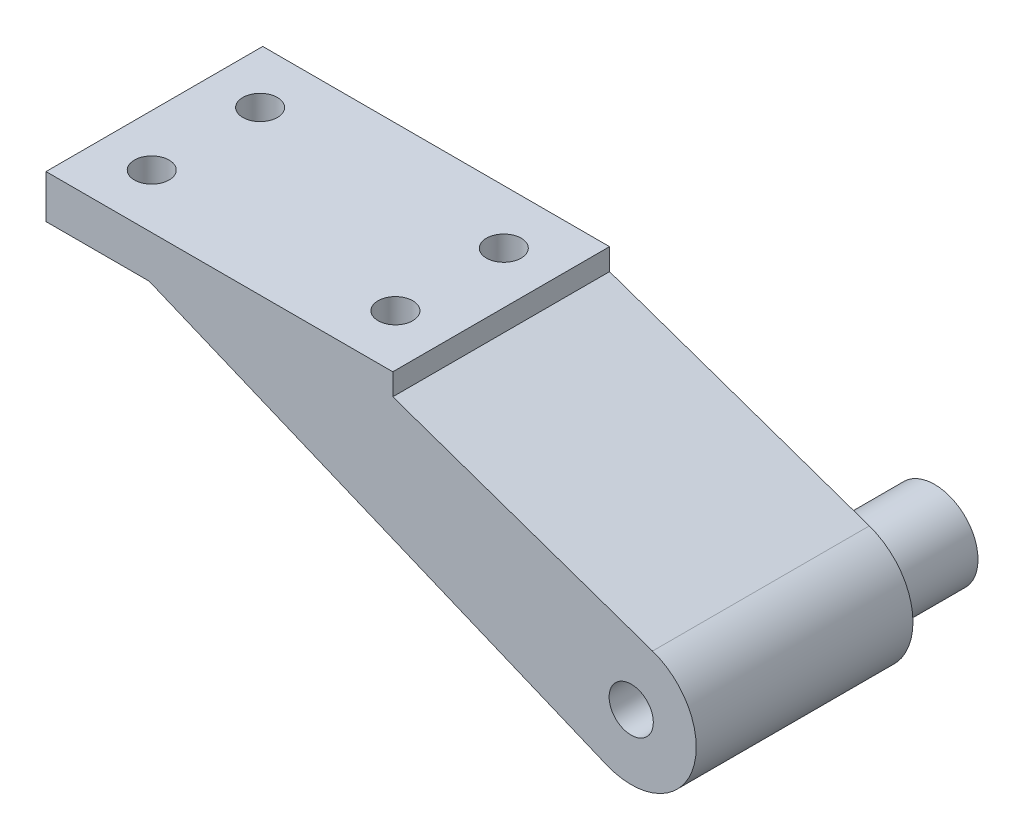
ISO-10303-21;
HEADER;
FILE_DESCRIPTION(('STEP AP214'),'2;1');
FILE_NAME('part.step','',(''),(''),'','','');
FILE_SCHEMA(('AUTOMOTIVE_DESIGN { 1 0 10303 214 1 1 1 1 }'));
ENDSEC;
DATA;
#1=APPLICATION_CONTEXT('core data for automotive mechanical design processes');
#2=APPLICATION_PROTOCOL_DEFINITION('international standard','automotive_design',2000,#1);
#3=PRODUCT_CONTEXT('',#1,'mechanical');
#4=PRODUCT('Part','Part','',(#3));
#5=PRODUCT_RELATED_PRODUCT_CATEGORY('part','',(#4));
#6=PRODUCT_DEFINITION_FORMATION('','',#4);
#7=PRODUCT_DEFINITION_CONTEXT('part definition',#1,'design');
#8=PRODUCT_DEFINITION('design','',#6,#7);
#9=PRODUCT_DEFINITION_SHAPE('','',#8);
#10=(LENGTH_UNIT() NAMED_UNIT(*) SI_UNIT(.MILLI.,.METRE.));
#11=(NAMED_UNIT(*) PLANE_ANGLE_UNIT() SI_UNIT($,.RADIAN.));
#12=(NAMED_UNIT(*) SI_UNIT($,.STERADIAN.) SOLID_ANGLE_UNIT());
#13=UNCERTAINTY_MEASURE_WITH_UNIT(LENGTH_MEASURE(1.E-05),#10,'distance_accuracy_value','');
#14=(GEOMETRIC_REPRESENTATION_CONTEXT(3) GLOBAL_UNCERTAINTY_ASSIGNED_CONTEXT((#13)) GLOBAL_UNIT_ASSIGNED_CONTEXT((#10,
#11,#12)) REPRESENTATION_CONTEXT('',''));
#15=CARTESIAN_POINT('',(0.,0.,0.));
#16=DIRECTION('',(0.,0.,1.));
#17=DIRECTION('',(1.,0.,0.));
#18=AXIS2_PLACEMENT_3D('',#15,#16,#17);
#19=CARTESIAN_POINT('',(43.2475049791949,-28.575,-7.9375));
#20=DIRECTION('',(0.,1.,0.));
#21=DIRECTION('',(0.,0.,1.));
#22=AXIS2_PLACEMENT_3D('',#19,#20,#21);
#23=CYLINDRICAL_SURFACE('',#22,2.54);
#24=CARTESIAN_POINT('',(43.2475049791949,6.35,-7.9375));
#25=DIRECTION('',(0.,1.,0.));
#26=DIRECTION('',(0.,0.,1.));
#27=AXIS2_PLACEMENT_3D('',#24,#25,#26);
#28=CIRCLE('',#27,2.54);
#29=CARTESIAN_POINT('',(43.2475049791949,6.35,-5.3975));
#30=VERTEX_POINT('',#29);
#31=EDGE_CURVE('E178',#30,#30,#28,.T.);
#32=ORIENTED_EDGE('',*,*,#31,.T.);
#33=EDGE_LOOP('',(#32));
#34=FACE_BOUND('',#33,.T.);
#35=CARTESIAN_POINT('',(43.2475049791949,0.,-7.9375));
#36=DIRECTION('',(0.,-1.,0.));
#37=DIRECTION('',(0.,0.,-1.));
#38=AXIS2_PLACEMENT_3D('',#35,#36,#37);
#39=CIRCLE('',#38,2.54);
#40=CARTESIAN_POINT('',(43.2475049791949,0.,-10.4775));
#41=VERTEX_POINT('',#40);
#42=EDGE_CURVE('E158',#41,#41,#39,.F.);
#43=ORIENTED_EDGE('',*,*,#42,.F.);
#44=EDGE_LOOP('',(#43));
#45=FACE_BOUND('',#44,.T.);
#46=ADVANCED_FACE('F32',(#34,#45),#23,.F.);
#47=CARTESIAN_POINT('',(43.2475049791949,-28.575,-23.8125));
#48=DIRECTION('',(0.,1.,0.));
#49=DIRECTION('',(0.,0.,1.));
#50=AXIS2_PLACEMENT_3D('',#47,#48,#49);
#51=CYLINDRICAL_SURFACE('',#50,2.54);
#52=CARTESIAN_POINT('',(43.2475049791949,6.35,-23.8125));
#53=DIRECTION('',(0.,1.,0.));
#54=DIRECTION('',(0.,0.,1.));
#55=AXIS2_PLACEMENT_3D('',#52,#53,#54);
#56=CIRCLE('',#55,2.54);
#57=CARTESIAN_POINT('',(43.2475049791949,6.35,-21.2725));
#58=VERTEX_POINT('',#57);
#59=EDGE_CURVE('E157',#58,#58,#56,.T.);
#60=ORIENTED_EDGE('',*,*,#59,.T.);
#61=EDGE_LOOP('',(#60));
#62=FACE_BOUND('',#61,.T.);
#63=CARTESIAN_POINT('',(43.2475049791949,0.,-23.8125));
#64=DIRECTION('',(0.,-1.,0.));
#65=DIRECTION('',(0.,0.,-1.));
#66=AXIS2_PLACEMENT_3D('',#63,#64,#65);
#67=CIRCLE('',#66,2.54);
#68=CARTESIAN_POINT('',(43.2475049791949,0.,-26.3525));
#69=VERTEX_POINT('',#68);
#70=EDGE_CURVE('E151',#69,#69,#67,.F.);
#71=ORIENTED_EDGE('',*,*,#70,.F.);
#72=EDGE_LOOP('',(#71));
#73=FACE_BOUND('',#72,.T.);
#74=ADVANCED_FACE('F227',(#62,#73),#51,.F.);
#75=CARTESIAN_POINT('',(0.,6.35,0.));
#76=DIRECTION('',(1.,0.,0.));
#77=DIRECTION('',(0.,0.,-1.));
#78=AXIS2_PLACEMENT_3D('',#75,#76,#77);
#79=PLANE('',#78);
#80=DIRECTION('',(0.,0.,1.));
#81=VECTOR('',#80,1.);
#82=CARTESIAN_POINT('',(0.,0.,0.));
#83=LINE('',#82,#81);
#84=CARTESIAN_POINT('',(0.,0.,-31.75));
#85=VERTEX_POINT('',#84);
#86=CARTESIAN_POINT('',(0.,0.,0.));
#87=VERTEX_POINT('',#86);
#88=EDGE_CURVE('E121',#85,#87,#83,.T.);
#89=ORIENTED_EDGE('',*,*,#88,.T.);
#90=DIRECTION('',(0.,-1.,0.));
#91=VECTOR('',#90,1.);
#92=CARTESIAN_POINT('',(0.,6.35,0.));
#93=LINE('',#92,#91);
#94=CARTESIAN_POINT('',(0.,6.35,0.));
#95=VERTEX_POINT('',#94);
#96=EDGE_CURVE('E11',#95,#87,#93,.T.);
#97=ORIENTED_EDGE('',*,*,#96,.F.);
#98=DIRECTION('',(0.,0.,1.));
#99=VECTOR('',#98,1.);
#100=CARTESIAN_POINT('',(0.,6.35,0.));
#101=LINE('',#100,#99);
#102=CARTESIAN_POINT('',(0.,6.35,-31.75));
#103=VERTEX_POINT('',#102);
#104=EDGE_CURVE('E133',#103,#95,#101,.T.);
#105=ORIENTED_EDGE('',*,*,#104,.F.);
#106=DIRECTION('',(0.,-1.,0.));
#107=VECTOR('',#106,1.);
#108=CARTESIAN_POINT('',(0.,6.35,-31.75));
#109=LINE('',#108,#107);
#110=EDGE_CURVE('E139',#103,#85,#109,.T.);
#111=ORIENTED_EDGE('',*,*,#110,.T.);
#112=EDGE_LOOP('',(#89,#97,#105,#111));
#113=FACE_BOUND('',#112,.T.);
#114=ADVANCED_FACE('F34',(#113),#79,.F.);
#115=CARTESIAN_POINT('',(0.,6.35,0.));
#116=DIRECTION('',(0.,0.,-1.));
#117=DIRECTION('',(-1.,0.,0.));
#118=AXIS2_PLACEMENT_3D('',#115,#116,#117);
#119=PLANE('',#118);
#120=DIRECTION('',(-0.944555017323204,0.328353192842039,0.));
#121=VECTOR('',#120,1.);
#122=CARTESIAN_POINT('',(50.8,3.175,0.));
#123=LINE('',#122,#121);
#124=CARTESIAN_POINT('',(88.8525641618204,-10.0531134599965,0.));
#125=VERTEX_POINT('',#124);
#126=CARTESIAN_POINT('',(50.8,3.175,0.));
#127=VERTEX_POINT('',#126);
#128=EDGE_CURVE('E128',#125,#127,#123,.T.);
#129=ORIENTED_EDGE('',*,*,#128,.T.);
#130=DIRECTION('',(0.,-1.,0.));
#131=VECTOR('',#130,1.);
#132=CARTESIAN_POINT('',(50.8,6.35,0.));
#133=LINE('',#132,#131);
#134=CARTESIAN_POINT('',(50.8,6.35,0.));
#135=VERTEX_POINT('',#134);
#136=EDGE_CURVE('E41',#135,#127,#133,.T.);
#137=ORIENTED_EDGE('',*,*,#136,.F.);
#138=DIRECTION('',(1.,0.,0.));
#139=VECTOR('',#138,1.);
#140=CARTESIAN_POINT('',(0.,6.35,0.));
#141=LINE('',#140,#139);
#142=EDGE_CURVE('E79',#95,#135,#141,.T.);
#143=ORIENTED_EDGE('',*,*,#142,.F.);
#144=ORIENTED_EDGE('',*,*,#96,.T.);
#145=DIRECTION('',(1.,0.,0.));
#146=VECTOR('',#145,1.);
#147=CARTESIAN_POINT('',(0.,0.,0.));
#148=LINE('',#147,#146);
#149=CARTESIAN_POINT('',(15.1049900416102,0.,0.));
#150=VERTEX_POINT('',#149);
#151=EDGE_CURVE('E142',#87,#150,#148,.T.);
#152=ORIENTED_EDGE('',*,*,#151,.T.);
#153=DIRECTION('',(0.923352092158858,-0.383954312263658,0.));
#154=VECTOR('',#153,1.);
#155=CARTESIAN_POINT('',(82.0678351756886,-27.8449286778131,0.));
#156=LINE('',#155,#154);
#157=CARTESIAN_POINT('',(82.0678351756886,-27.8449286778131,0.));
#158=VERTEX_POINT('',#157);
#159=EDGE_CURVE('E116',#150,#158,#156,.T.);
#160=ORIENTED_EDGE('',*,*,#159,.T.);
#161=CARTESIAN_POINT('',(85.725,-19.05,0.));
#162=DIRECTION('',(0.,0.,1.));
#163=DIRECTION('',(1.,0.,0.));
#164=AXIS2_PLACEMENT_3D('',#161,#162,#163);
#165=CIRCLE('',#164,9.52500000000001);
#166=EDGE_CURVE('E107',#158,#125,#165,.T.);
#167=ORIENTED_EDGE('',*,*,#166,.T.);
#168=EDGE_LOOP('',(#129,#137,#143,#144,#152,#160,#167));
#169=FACE_BOUND('',#168,.T.);
#170=CARTESIAN_POINT('',(85.725,-19.05,0.));
#171=DIRECTION('',(0.,0.,1.));
#172=DIRECTION('',(1.,0.,0.));
#173=AXIS2_PLACEMENT_3D('',#170,#171,#172);
#174=CIRCLE('',#173,3.23850000000001);
#175=CARTESIAN_POINT('',(88.9635,-19.05,0.));
#176=VERTEX_POINT('',#175);
#177=EDGE_CURVE('E192',#176,#176,#174,.T.);
#178=ORIENTED_EDGE('',*,*,#177,.F.);
#179=EDGE_LOOP('',(#178));
#180=FACE_BOUND('',#179,.T.);
#181=ADVANCED_FACE('F197',(#169,#180),#119,.F.);
#182=CARTESIAN_POINT('',(50.8,6.35,0.));
#183=DIRECTION('',(-1.,0.,0.));
#184=DIRECTION('',(0.,0.,1.));
#185=AXIS2_PLACEMENT_3D('',#182,#183,#184);
#186=PLANE('',#185);
#187=ORIENTED_EDGE('',*,*,#136,.T.);
#188=DIRECTION('',(0.,0.,1.));
#189=VECTOR('',#188,1.);
#190=CARTESIAN_POINT('',(50.8,3.175,-111.755878932692));
#191=LINE('',#190,#189);
#192=CARTESIAN_POINT('',(50.8,3.175,-31.75));
#193=VERTEX_POINT('',#192);
#194=EDGE_CURVE('E119',#193,#127,#191,.T.);
#195=ORIENTED_EDGE('',*,*,#194,.F.);
#196=DIRECTION('',(0.,-1.,0.));
#197=VECTOR('',#196,1.);
#198=CARTESIAN_POINT('',(50.8,6.35,-31.75));
#199=LINE('',#198,#197);
#200=CARTESIAN_POINT('',(50.8,6.35,-31.75));
#201=VERTEX_POINT('',#200);
#202=EDGE_CURVE('E147',#201,#193,#199,.T.);
#203=ORIENTED_EDGE('',*,*,#202,.F.);
#204=DIRECTION('',(0.,0.,-1.));
#205=VECTOR('',#204,1.);
#206=CARTESIAN_POINT('',(50.8,6.35,0.));
#207=LINE('',#206,#205);
#208=EDGE_CURVE('E136',#135,#201,#207,.T.);
#209=ORIENTED_EDGE('',*,*,#208,.F.);
#210=EDGE_LOOP('',(#187,#195,#203,#209));
#211=FACE_BOUND('',#210,.T.);
#212=ADVANCED_FACE('F204',(#211),#186,.F.);
#213=CARTESIAN_POINT('',(0.,6.35,-31.75));
#214=DIRECTION('',(0.,0.,1.));
#215=DIRECTION('',(1.,0.,0.));
#216=AXIS2_PLACEMENT_3D('',#213,#214,#215);
#217=PLANE('',#216);
#218=CARTESIAN_POINT('',(85.725,-19.05,-31.75));
#219=DIRECTION('',(0.,0.,1.));
#220=DIRECTION('',(1.,0.,0.));
#221=AXIS2_PLACEMENT_3D('',#218,#219,#220);
#222=CIRCLE('',#221,6.35);
#223=CARTESIAN_POINT('',(92.075,-19.05,-31.75));
#224=VERTEX_POINT('',#223);
#225=EDGE_CURVE('E170',#224,#224,#222,.T.);
#226=ORIENTED_EDGE('',*,*,#225,.T.);
#227=EDGE_LOOP('',(#226));
#228=FACE_BOUND('',#227,.T.);
#229=ORIENTED_EDGE('',*,*,#202,.T.);
#230=DIRECTION('',(0.944555017323204,-0.328353192842039,0.));
#231=VECTOR('',#230,1.);
#232=CARTESIAN_POINT('',(50.8,3.175,-31.75));
#233=LINE('',#232,#231);
#234=CARTESIAN_POINT('',(88.8525641618204,-10.0531134599965,-31.75));
#235=VERTEX_POINT('',#234);
#236=EDGE_CURVE('E114',#193,#235,#233,.T.);
#237=ORIENTED_EDGE('',*,*,#236,.T.);
#238=CARTESIAN_POINT('',(85.725,-19.05,-31.75));
#239=DIRECTION('',(0.,0.,1.));
#240=DIRECTION('',(1.,0.,0.));
#241=AXIS2_PLACEMENT_3D('',#238,#239,#240);
#242=CIRCLE('',#241,9.52500000000001);
#243=CARTESIAN_POINT('',(82.0678351756886,-27.8449286778131,-31.75));
#244=VERTEX_POINT('',#243);
#245=EDGE_CURVE('E104',#235,#244,#242,.F.);
#246=ORIENTED_EDGE('',*,*,#245,.T.);
#247=DIRECTION('',(-0.923352092158859,0.383954312263658,0.));
#248=VECTOR('',#247,1.);
#249=CARTESIAN_POINT('',(82.0678351756886,-27.8449286778131,-31.75));
#250=LINE('',#249,#248);
#251=CARTESIAN_POINT('',(15.1049900416102,0.,-31.75));
#252=VERTEX_POINT('',#251);
#253=EDGE_CURVE('E113',#244,#252,#250,.T.);
#254=ORIENTED_EDGE('',*,*,#253,.T.);
#255=DIRECTION('',(-1.,0.,0.));
#256=VECTOR('',#255,1.);
#257=CARTESIAN_POINT('',(0.,0.,-31.75));
#258=LINE('',#257,#256);
#259=EDGE_CURVE('E72',#252,#85,#258,.T.);
#260=ORIENTED_EDGE('',*,*,#259,.T.);
#261=ORIENTED_EDGE('',*,*,#110,.F.);
#262=DIRECTION('',(-1.,0.,0.));
#263=VECTOR('',#262,1.);
#264=CARTESIAN_POINT('',(0.,6.35,-31.75));
#265=LINE('',#264,#263);
#266=EDGE_CURVE('E58',#201,#103,#265,.T.);
#267=ORIENTED_EDGE('',*,*,#266,.F.);
#268=EDGE_LOOP('',(#229,#237,#246,#254,#260,#261,#267));
#269=FACE_BOUND('',#268,.T.);
#270=ADVANCED_FACE('F112',(#228,#269),#217,.F.);
#271=CARTESIAN_POINT('',(0.,6.35,0.));
#272=DIRECTION('',(0.,-1.,0.));
#273=DIRECTION('',(0.,0.,-1.));
#274=AXIS2_PLACEMENT_3D('',#271,#272,#273);
#275=PLANE('',#274);
#276=ORIENTED_EDGE('',*,*,#59,.F.);
#277=EDGE_LOOP('',(#276));
#278=FACE_BOUND('',#277,.T.);
#279=ORIENTED_EDGE('',*,*,#31,.F.);
#280=EDGE_LOOP('',(#279));
#281=FACE_BOUND('',#280,.T.);
#282=CARTESIAN_POINT('',(7.55249502080511,6.35,-23.8125));
#283=DIRECTION('',(0.,-1.,0.));
#284=DIRECTION('',(0.,0.,-1.));
#285=AXIS2_PLACEMENT_3D('',#282,#283,#284);
#286=CIRCLE('',#285,2.54);
#287=CARTESIAN_POINT('',(7.55249502080511,6.35,-26.3525));
#288=VERTEX_POINT('',#287);
#289=EDGE_CURVE('E184',#288,#288,#286,.F.);
#290=ORIENTED_EDGE('',*,*,#289,.F.);
#291=EDGE_LOOP('',(#290));
#292=FACE_BOUND('',#291,.T.);
#293=CARTESIAN_POINT('',(7.5524950208051,6.35,-7.9375));
#294=DIRECTION('',(0.,-1.,0.));
#295=DIRECTION('',(0.,0.,-1.));
#296=AXIS2_PLACEMENT_3D('',#293,#294,#295);
#297=CIRCLE('',#296,2.54);
#298=CARTESIAN_POINT('',(7.5524950208051,6.35,-10.4775));
#299=VERTEX_POINT('',#298);
#300=EDGE_CURVE('E190',#299,#299,#297,.F.);
#301=ORIENTED_EDGE('',*,*,#300,.F.);
#302=EDGE_LOOP('',(#301));
#303=FACE_BOUND('',#302,.T.);
#304=ORIENTED_EDGE('',*,*,#104,.T.);
#305=ORIENTED_EDGE('',*,*,#142,.T.);
#306=ORIENTED_EDGE('',*,*,#208,.T.);
#307=ORIENTED_EDGE('',*,*,#266,.T.);
#308=EDGE_LOOP('',(#304,#305,#306,#307));
#309=FACE_BOUND('',#308,.T.);
#310=ADVANCED_FACE('F210',(#278,#281,#292,#303,#309),#275,.F.);
#311=CARTESIAN_POINT('',(0.,0.,0.));
#312=DIRECTION('',(0.,-1.,0.));
#313=DIRECTION('',(0.,0.,-1.));
#314=AXIS2_PLACEMENT_3D('',#311,#312,#313);
#315=PLANE('',#314);
#316=CARTESIAN_POINT('',(7.55249502080511,0.,-23.8125));
#317=DIRECTION('',(0.,-1.,0.));
#318=DIRECTION('',(0.,0.,-1.));
#319=AXIS2_PLACEMENT_3D('',#316,#317,#318);
#320=CIRCLE('',#319,2.54);
#321=CARTESIAN_POINT('',(7.55249502080511,0.,-26.3525));
#322=VERTEX_POINT('',#321);
#323=EDGE_CURVE('E181',#322,#322,#320,.T.);
#324=ORIENTED_EDGE('',*,*,#323,.F.);
#325=EDGE_LOOP('',(#324));
#326=FACE_BOUND('',#325,.T.);
#327=CARTESIAN_POINT('',(7.5524950208051,0.,-7.9375));
#328=DIRECTION('',(0.,-1.,0.));
#329=DIRECTION('',(0.,0.,-1.));
#330=AXIS2_PLACEMENT_3D('',#327,#328,#329);
#331=CIRCLE('',#330,2.54);
#332=CARTESIAN_POINT('',(7.5524950208051,0.,-10.4775));
#333=VERTEX_POINT('',#332);
#334=EDGE_CURVE('E187',#333,#333,#331,.T.);
#335=ORIENTED_EDGE('',*,*,#334,.F.);
#336=EDGE_LOOP('',(#335));
#337=FACE_BOUND('',#336,.T.);
#338=DIRECTION('',(0.,0.,1.));
#339=VECTOR('',#338,1.);
#340=CARTESIAN_POINT('',(15.1049900416102,0.,-111.755878932692));
#341=LINE('',#340,#339);
#342=EDGE_CURVE('E49',#252,#150,#341,.T.);
#343=ORIENTED_EDGE('',*,*,#342,.T.);
#344=ORIENTED_EDGE('',*,*,#151,.F.);
#345=ORIENTED_EDGE('',*,*,#88,.F.);
#346=ORIENTED_EDGE('',*,*,#259,.F.);
#347=EDGE_LOOP('',(#343,#344,#345,#346));
#348=FACE_BOUND('',#347,.T.);
#349=ADVANCED_FACE('F212',(#326,#337,#348),#315,.T.);
#350=CARTESIAN_POINT('',(50.8,3.175,-111.755878932692));
#351=DIRECTION('',(0.328353192842039,0.944555017323204,0.));
#352=DIRECTION('',(-0.944555017323204,0.328353192842039,0.));
#353=AXIS2_PLACEMENT_3D('',#350,#351,#352);
#354=PLANE('',#353);
#355=ORIENTED_EDGE('',*,*,#236,.F.);
#356=ORIENTED_EDGE('',*,*,#194,.T.);
#357=ORIENTED_EDGE('',*,*,#128,.F.);
#358=DIRECTION('',(0.,0.,1.));
#359=VECTOR('',#358,1.);
#360=CARTESIAN_POINT('',(88.8525641618204,-10.0531134599965,-111.755878932692));
#361=LINE('',#360,#359);
#362=EDGE_CURVE('E109',#235,#125,#361,.T.);
#363=ORIENTED_EDGE('',*,*,#362,.F.);
#364=EDGE_LOOP('',(#355,#356,#357,#363));
#365=FACE_BOUND('',#364,.T.);
#366=ADVANCED_FACE('F200',(#365),#354,.T.);
#367=CARTESIAN_POINT('',(82.0678351756886,-27.8449286778131,-111.755878932692));
#368=DIRECTION('',(-0.383954312263658,-0.923352092158859,0.));
#369=DIRECTION('',(0.923352092158859,-0.383954312263658,0.));
#370=AXIS2_PLACEMENT_3D('',#367,#368,#369);
#371=PLANE('',#370);
#372=CARTESIAN_POINT('',(43.2475049791949,-11.7024048139277,-7.9375));
#373=DIRECTION('',(-0.383954312263658,-0.923352092158859,0.));
#374=DIRECTION('',(0.923352092158859,-0.383954312263658,0.));
#375=AXIS2_PLACEMENT_3D('',#372,#373,#374);
#376=ELLIPSE('',#375,5.15783744948794,4.7625);
#377=CARTESIAN_POINT('',(48.0100049791949,-13.6827787446136,-7.9375));
#378=VERTEX_POINT('',#377);
#379=EDGE_CURVE('E36',#378,#378,#376,.F.);
#380=ORIENTED_EDGE('',*,*,#379,.T.);
#381=EDGE_LOOP('',(#380));
#382=FACE_BOUND('',#381,.T.);
#383=CARTESIAN_POINT('',(43.2475049791949,-11.7024048139277,-23.8125));
#384=DIRECTION('',(-0.383954312263658,-0.923352092158859,0.));
#385=DIRECTION('',(0.923352092158859,-0.383954312263658,0.));
#386=AXIS2_PLACEMENT_3D('',#383,#384,#385);
#387=ELLIPSE('',#386,5.15783744948794,4.7625);
#388=CARTESIAN_POINT('',(48.0100049791949,-13.6827787446136,-23.8125));
#389=VERTEX_POINT('',#388);
#390=EDGE_CURVE('E154',#389,#389,#387,.F.);
#391=ORIENTED_EDGE('',*,*,#390,.T.);
#392=EDGE_LOOP('',(#391));
#393=FACE_BOUND('',#392,.T.);
#394=ORIENTED_EDGE('',*,*,#253,.F.);
#395=DIRECTION('',(0.,0.,1.));
#396=VECTOR('',#395,1.);
#397=CARTESIAN_POINT('',(82.0678351756886,-27.8449286778131,-111.755878932692));
#398=LINE('',#397,#396);
#399=EDGE_CURVE('E101',#244,#158,#398,.T.);
#400=ORIENTED_EDGE('',*,*,#399,.T.);
#401=ORIENTED_EDGE('',*,*,#159,.F.);
#402=ORIENTED_EDGE('',*,*,#342,.F.);
#403=EDGE_LOOP('',(#394,#400,#401,#402));
#404=FACE_BOUND('',#403,.T.);
#405=ADVANCED_FACE('F118',(#382,#393,#404),#371,.T.);
#406=CARTESIAN_POINT('',(85.725,-19.05,-58.6907683632075));
#407=DIRECTION('',(0.,0.,1.));
#408=DIRECTION('',(1.,0.,0.));
#409=AXIS2_PLACEMENT_3D('',#406,#407,#408);
#410=CYLINDRICAL_SURFACE('',#409,9.52500000000001);
#411=ORIENTED_EDGE('',*,*,#245,.F.);
#412=ORIENTED_EDGE('',*,*,#362,.T.);
#413=ORIENTED_EDGE('',*,*,#166,.F.);
#414=ORIENTED_EDGE('',*,*,#399,.F.);
#415=EDGE_LOOP('',(#411,#412,#413,#414));
#416=FACE_BOUND('',#415,.T.);
#417=ADVANCED_FACE('F103',(#416),#410,.T.);
#418=CARTESIAN_POINT('',(85.725,-19.05,-58.6907683632075));
#419=DIRECTION('',(0.,0.,1.));
#420=DIRECTION('',(1.,0.,0.));
#421=AXIS2_PLACEMENT_3D('',#418,#419,#420);
#422=CYLINDRICAL_SURFACE('',#421,3.23850000000001);
#423=ORIENTED_EDGE('',*,*,#177,.T.);
#424=EDGE_LOOP('',(#423));
#425=FACE_BOUND('',#424,.T.);
#426=CARTESIAN_POINT('',(85.725,-19.05,-44.45));
#427=DIRECTION('',(0.,0.,1.));
#428=DIRECTION('',(1.,0.,0.));
#429=AXIS2_PLACEMENT_3D('',#426,#427,#428);
#430=CIRCLE('',#429,3.23850000000001);
#431=CARTESIAN_POINT('',(88.9635,-19.05,-44.45));
#432=VERTEX_POINT('',#431);
#433=EDGE_CURVE('E293',#432,#432,#430,.T.);
#434=ORIENTED_EDGE('',*,*,#433,.F.);
#435=EDGE_LOOP('',(#434));
#436=FACE_BOUND('',#435,.T.);
#437=ADVANCED_FACE('F246',(#425,#436),#422,.F.);
#438=CARTESIAN_POINT('',(7.5524950208051,6.351,-7.9375));
#439=DIRECTION('',(0.,-1.,0.));
#440=DIRECTION('',(0.,0.,-1.));
#441=AXIS2_PLACEMENT_3D('',#438,#439,#440);
#442=CYLINDRICAL_SURFACE('',#441,2.54);
#443=ORIENTED_EDGE('',*,*,#334,.T.);
#444=EDGE_LOOP('',(#443));
#445=FACE_BOUND('',#444,.T.);
#446=ORIENTED_EDGE('',*,*,#300,.T.);
#447=EDGE_LOOP('',(#446));
#448=FACE_BOUND('',#447,.T.);
#449=ADVANCED_FACE('F242',(#445,#448),#442,.F.);
#450=CARTESIAN_POINT('',(7.55249502080511,6.351,-23.8125));
#451=DIRECTION('',(0.,-1.,0.));
#452=DIRECTION('',(0.,0.,-1.));
#453=AXIS2_PLACEMENT_3D('',#450,#451,#452);
#454=CYLINDRICAL_SURFACE('',#453,2.54);
#455=ORIENTED_EDGE('',*,*,#323,.T.);
#456=EDGE_LOOP('',(#455));
#457=FACE_BOUND('',#456,.T.);
#458=ORIENTED_EDGE('',*,*,#289,.T.);
#459=EDGE_LOOP('',(#458));
#460=FACE_BOUND('',#459,.T.);
#461=ADVANCED_FACE('F238',(#457,#460),#454,.F.);
#462=CARTESIAN_POINT('',(0.,0.,0.));
#463=DIRECTION('',(0.,-1.,0.));
#464=DIRECTION('',(0.,0.,-1.));
#465=AXIS2_PLACEMENT_3D('',#462,#463,#464);
#466=PLANE('',#465);
#467=CARTESIAN_POINT('',(43.2475049791949,0.,-23.8125));
#468=DIRECTION('',(0.,-1.,0.));
#469=DIRECTION('',(0.,0.,-1.));
#470=AXIS2_PLACEMENT_3D('',#467,#468,#469);
#471=CIRCLE('',#470,4.7625);
#472=CARTESIAN_POINT('',(43.2475049791949,0.,-28.575));
#473=VERTEX_POINT('',#472);
#474=EDGE_CURVE('E155',#473,#473,#471,.T.);
#475=ORIENTED_EDGE('',*,*,#474,.T.);
#476=EDGE_LOOP('',(#475));
#477=FACE_BOUND('',#476,.T.);
#478=ORIENTED_EDGE('',*,*,#70,.T.);
#479=EDGE_LOOP('',(#478));
#480=FACE_BOUND('',#479,.T.);
#481=ADVANCED_FACE('F241',(#477,#480),#466,.T.);
#482=CARTESIAN_POINT('',(43.2475049791949,13.4703841816037,-23.8125));
#483=DIRECTION('',(0.,-1.,0.));
#484=DIRECTION('',(0.,0.,-1.));
#485=AXIS2_PLACEMENT_3D('',#482,#483,#484);
#486=CYLINDRICAL_SURFACE('',#485,4.7625);
#487=ORIENTED_EDGE('',*,*,#390,.F.);
#488=EDGE_LOOP('',(#487));
#489=FACE_BOUND('',#488,.T.);
#490=ORIENTED_EDGE('',*,*,#474,.F.);
#491=EDGE_LOOP('',(#490));
#492=FACE_BOUND('',#491,.T.);
#493=ADVANCED_FACE('F261',(#489,#492),#486,.F.);
#494=CARTESIAN_POINT('',(0.,0.,0.));
#495=DIRECTION('',(0.,-1.,0.));
#496=DIRECTION('',(0.,0.,-1.));
#497=AXIS2_PLACEMENT_3D('',#494,#495,#496);
#498=PLANE('',#497);
#499=CARTESIAN_POINT('',(43.2475049791949,0.,-7.9375));
#500=DIRECTION('',(0.,-1.,0.));
#501=DIRECTION('',(0.,0.,-1.));
#502=AXIS2_PLACEMENT_3D('',#499,#500,#501);
#503=CIRCLE('',#502,4.7625);
#504=CARTESIAN_POINT('',(43.2475049791949,0.,-12.7));
#505=VERTEX_POINT('',#504);
#506=EDGE_CURVE('E160',#505,#505,#503,.T.);
#507=ORIENTED_EDGE('',*,*,#506,.T.);
#508=EDGE_LOOP('',(#507));
#509=FACE_BOUND('',#508,.T.);
#510=ORIENTED_EDGE('',*,*,#42,.T.);
#511=EDGE_LOOP('',(#510));
#512=FACE_BOUND('',#511,.T.);
#513=ADVANCED_FACE('F264',(#509,#512),#498,.T.);
#514=CARTESIAN_POINT('',(43.2475049791949,13.4703841816037,-7.9375));
#515=DIRECTION('',(0.,-1.,0.));
#516=DIRECTION('',(0.,0.,-1.));
#517=AXIS2_PLACEMENT_3D('',#514,#515,#516);
#518=CYLINDRICAL_SURFACE('',#517,4.7625);
#519=ORIENTED_EDGE('',*,*,#379,.F.);
#520=EDGE_LOOP('',(#519));
#521=FACE_BOUND('',#520,.T.);
#522=ORIENTED_EDGE('',*,*,#506,.F.);
#523=EDGE_LOOP('',(#522));
#524=FACE_BOUND('',#523,.T.);
#525=ADVANCED_FACE('F275',(#521,#524),#518,.F.);
#526=CARTESIAN_POINT('',(85.725,-19.05,-44.45));
#527=DIRECTION('',(0.,0.,1.));
#528=DIRECTION('',(1.,0.,0.));
#529=AXIS2_PLACEMENT_3D('',#526,#527,#528);
#530=CYLINDRICAL_SURFACE('',#529,6.35);
#531=CARTESIAN_POINT('',(85.725,-19.05,-44.45));
#532=DIRECTION('',(0.,0.,1.));
#533=DIRECTION('',(1.,0.,0.));
#534=AXIS2_PLACEMENT_3D('',#531,#532,#533);
#535=CIRCLE('',#534,6.35);
#536=CARTESIAN_POINT('',(92.075,-19.05,-44.45));
#537=VERTEX_POINT('',#536);
#538=EDGE_CURVE('E165',#537,#537,#535,.T.);
#539=ORIENTED_EDGE('',*,*,#538,.T.);
#540=EDGE_LOOP('',(#539));
#541=FACE_BOUND('',#540,.T.);
#542=ORIENTED_EDGE('',*,*,#225,.F.);
#543=EDGE_LOOP('',(#542));
#544=FACE_BOUND('',#543,.T.);
#545=ADVANCED_FACE('F278',(#541,#544),#530,.T.);
#546=CARTESIAN_POINT('',(85.725,-19.05,-44.45));
#547=DIRECTION('',(0.,0.,1.));
#548=DIRECTION('',(1.,0.,0.));
#549=AXIS2_PLACEMENT_3D('',#546,#547,#548);
#550=PLANE('',#549);
#551=ORIENTED_EDGE('',*,*,#433,.T.);
#552=EDGE_LOOP('',(#551));
#553=FACE_BOUND('',#552,.T.);
#554=ORIENTED_EDGE('',*,*,#538,.F.);
#555=EDGE_LOOP('',(#554));
#556=FACE_BOUND('',#555,.T.);
#557=ADVANCED_FACE('F284',(#553,#556),#550,.F.);
#558=CLOSED_SHELL('',(#46,#74,#114,#181,#212,#270,#310,#349,#366,#405,#417,#437,#449,#461,#481,
#493,#513,#525,#545,#557));
#559=MANIFOLD_SOLID_BREP('B2',#558);
#560=ADVANCED_BREP_SHAPE_REPRESENTATION('',(#18,#559),#14);
#561=SHAPE_DEFINITION_REPRESENTATION(#9,#560);
ENDSEC;
END-ISO-10303-21;
